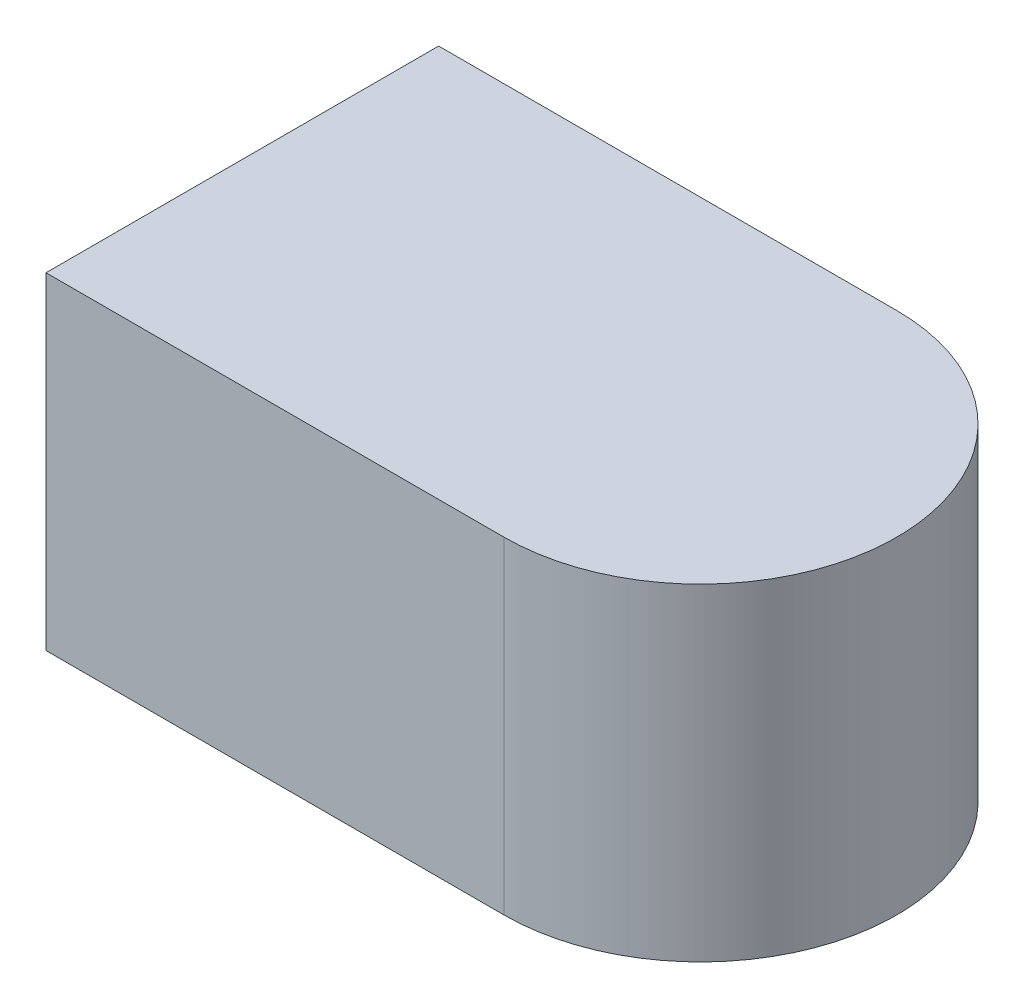
ISO-10303-21;
HEADER;
FILE_DESCRIPTION(('STEP AP214'),'2;1');
FILE_NAME('part.step','',(''),(''),'','','');
FILE_SCHEMA(('AUTOMOTIVE_DESIGN { 1 0 10303 214 1 1 1 1 }'));
ENDSEC;
DATA;
#1=APPLICATION_CONTEXT('core data for automotive mechanical design processes');
#2=APPLICATION_PROTOCOL_DEFINITION('international standard','automotive_design',2000,#1);
#3=PRODUCT_CONTEXT('',#1,'mechanical');
#4=PRODUCT('Part','Part','',(#3));
#5=PRODUCT_RELATED_PRODUCT_CATEGORY('part','',(#4));
#6=PRODUCT_DEFINITION_FORMATION('','',#4);
#7=PRODUCT_DEFINITION_CONTEXT('part definition',#1,'design');
#8=PRODUCT_DEFINITION('design','',#6,#7);
#9=PRODUCT_DEFINITION_SHAPE('','',#8);
#10=(LENGTH_UNIT() NAMED_UNIT(*) SI_UNIT(.MILLI.,.METRE.));
#11=(NAMED_UNIT(*) PLANE_ANGLE_UNIT() SI_UNIT($,.RADIAN.));
#12=(NAMED_UNIT(*) SI_UNIT($,.STERADIAN.) SOLID_ANGLE_UNIT());
#13=UNCERTAINTY_MEASURE_WITH_UNIT(LENGTH_MEASURE(1.E-05),#10,'distance_accuracy_value','');
#14=(GEOMETRIC_REPRESENTATION_CONTEXT(3) GLOBAL_UNCERTAINTY_ASSIGNED_CONTEXT((#13)) GLOBAL_UNIT_ASSIGNED_CONTEXT((#10,
#11,#12)) REPRESENTATION_CONTEXT('',''));
#15=CARTESIAN_POINT('',(0.,0.,0.));
#16=DIRECTION('',(0.,0.,1.));
#17=DIRECTION('',(1.,0.,0.));
#18=AXIS2_PLACEMENT_3D('',#15,#16,#17);
#19=CARTESIAN_POINT('',(0.,0.,0.));
#20=DIRECTION('',(0.,-1.,0.));
#21=DIRECTION('',(-1.,0.,0.));
#22=AXIS2_PLACEMENT_3D('',#19,#20,#21);
#23=PLANE('',#22);
#24=CARTESIAN_POINT('',(-1.47,0.,-1.75));
#25=DIRECTION('',(0.,-1.,0.));
#26=DIRECTION('',(0.,0.,-1.));
#27=AXIS2_PLACEMENT_3D('',#24,#25,#26);
#28=CIRCLE('',#27,0.12);
#29=CARTESIAN_POINT('',(-1.47,0.,-1.87));
#30=VERTEX_POINT('',#29);
#31=CARTESIAN_POINT('',(-1.47,0.,-1.63));
#32=VERTEX_POINT('',#31);
#33=EDGE_CURVE('E11',#30,#32,#28,.T.);
#34=ORIENTED_EDGE('',*,*,#33,.T.);
#35=DIRECTION('',(-1.,0.,0.));
#36=VECTOR('',#35,1.);
#37=CARTESIAN_POINT('',(-1.47,0.,-1.63));
#38=LINE('',#37,#36);
#39=CARTESIAN_POINT('',(-1.75,0.,-1.63));
#40=VERTEX_POINT('',#39);
#41=EDGE_CURVE('E24',#32,#40,#38,.T.);
#42=ORIENTED_EDGE('',*,*,#41,.T.);
#43=DIRECTION('',(0.,0.,-1.));
#44=VECTOR('',#43,1.);
#45=CARTESIAN_POINT('',(-1.75,0.,-1.63));
#46=LINE('',#45,#44);
#47=CARTESIAN_POINT('',(-1.75,0.,-1.87));
#48=VERTEX_POINT('',#47);
#49=EDGE_CURVE('E62',#40,#48,#46,.T.);
#50=ORIENTED_EDGE('',*,*,#49,.T.);
#51=DIRECTION('',(1.,0.,0.));
#52=VECTOR('',#51,1.);
#53=CARTESIAN_POINT('',(-1.75,0.,-1.87));
#54=LINE('',#53,#52);
#55=EDGE_CURVE('E36',#48,#30,#54,.T.);
#56=ORIENTED_EDGE('',*,*,#55,.T.);
#57=EDGE_LOOP('',(#34,#42,#50,#56));
#58=FACE_BOUND('',#57,.T.);
#59=ADVANCED_FACE('F17',(#58),#23,.T.);
#60=CARTESIAN_POINT('',(-1.75,0.,-1.87));
#61=DIRECTION('',(0.,0.,1.));
#62=DIRECTION('',(1.,0.,0.));
#63=AXIS2_PLACEMENT_3D('',#60,#61,#62);
#64=PLANE('',#63);
#65=DIRECTION('',(0.,1.,0.));
#66=VECTOR('',#65,1.);
#67=CARTESIAN_POINT('',(-1.75,0.,-1.87));
#68=LINE('',#67,#66);
#69=CARTESIAN_POINT('',(-1.75,0.2,-1.87));
#70=VERTEX_POINT('',#69);
#71=EDGE_CURVE('E84',#48,#70,#68,.T.);
#72=ORIENTED_EDGE('',*,*,#71,.T.);
#73=DIRECTION('',(1.,0.,0.));
#74=VECTOR('',#73,1.);
#75=CARTESIAN_POINT('',(-1.75,0.2,-1.87));
#76=LINE('',#75,#74);
#77=CARTESIAN_POINT('',(-1.47,0.2,-1.87));
#78=VERTEX_POINT('',#77);
#79=EDGE_CURVE('E74',#70,#78,#76,.T.);
#80=ORIENTED_EDGE('',*,*,#79,.T.);
#81=DIRECTION('',(0.,1.,0.));
#82=VECTOR('',#81,1.);
#83=CARTESIAN_POINT('',(-1.47,0.,-1.87));
#84=LINE('',#83,#82);
#85=EDGE_CURVE('E81',#30,#78,#84,.T.);
#86=ORIENTED_EDGE('',*,*,#85,.F.);
#87=ORIENTED_EDGE('',*,*,#55,.F.);
#88=EDGE_LOOP('',(#72,#80,#86,#87));
#89=FACE_BOUND('',#88,.T.);
#90=ADVANCED_FACE('F91',(#89),#64,.F.);
#91=CARTESIAN_POINT('',(-1.47,0.,-1.75));
#92=DIRECTION('',(0.,-1.,0.));
#93=DIRECTION('',(-1.,0.,0.));
#94=AXIS2_PLACEMENT_3D('',#91,#92,#93);
#95=CYLINDRICAL_SURFACE('',#94,0.12);
#96=ORIENTED_EDGE('',*,*,#85,.T.);
#97=CARTESIAN_POINT('',(-1.47,0.2,-1.75));
#98=DIRECTION('',(0.,-1.,0.));
#99=DIRECTION('',(0.,0.,-1.));
#100=AXIS2_PLACEMENT_3D('',#97,#98,#99);
#101=CIRCLE('',#100,0.12);
#102=CARTESIAN_POINT('',(-1.47,0.2,-1.63));
#103=VERTEX_POINT('',#102);
#104=EDGE_CURVE('E79',#78,#103,#101,.T.);
#105=ORIENTED_EDGE('',*,*,#104,.T.);
#106=DIRECTION('',(0.,1.,0.));
#107=VECTOR('',#106,1.);
#108=CARTESIAN_POINT('',(-1.47,0.,-1.63));
#109=LINE('',#108,#107);
#110=EDGE_CURVE('E68',#32,#103,#109,.T.);
#111=ORIENTED_EDGE('',*,*,#110,.F.);
#112=ORIENTED_EDGE('',*,*,#33,.F.);
#113=EDGE_LOOP('',(#96,#105,#111,#112));
#114=FACE_BOUND('',#113,.T.);
#115=ADVANCED_FACE('F89',(#114),#95,.T.);
#116=CARTESIAN_POINT('',(-1.47,0.,-1.63));
#117=DIRECTION('',(0.,0.,-1.));
#118=DIRECTION('',(-1.,0.,0.));
#119=AXIS2_PLACEMENT_3D('',#116,#117,#118);
#120=PLANE('',#119);
#121=ORIENTED_EDGE('',*,*,#110,.T.);
#122=DIRECTION('',(-1.,0.,0.));
#123=VECTOR('',#122,1.);
#124=CARTESIAN_POINT('',(-1.47,0.2,-1.63));
#125=LINE('',#124,#123);
#126=CARTESIAN_POINT('',(-1.75,0.2,-1.63));
#127=VERTEX_POINT('',#126);
#128=EDGE_CURVE('E63',#103,#127,#125,.T.);
#129=ORIENTED_EDGE('',*,*,#128,.T.);
#130=DIRECTION('',(0.,1.,0.));
#131=VECTOR('',#130,1.);
#132=CARTESIAN_POINT('',(-1.75,0.,-1.63));
#133=LINE('',#132,#131);
#134=EDGE_CURVE('E56',#40,#127,#133,.T.);
#135=ORIENTED_EDGE('',*,*,#134,.F.);
#136=ORIENTED_EDGE('',*,*,#41,.F.);
#137=EDGE_LOOP('',(#121,#129,#135,#136));
#138=FACE_BOUND('',#137,.T.);
#139=ADVANCED_FACE('F66',(#138),#120,.F.);
#140=CARTESIAN_POINT('',(-1.75,0.,-1.63));
#141=DIRECTION('',(1.,0.,0.));
#142=DIRECTION('',(0.,0.,-1.));
#143=AXIS2_PLACEMENT_3D('',#140,#141,#142);
#144=PLANE('',#143);
#145=ORIENTED_EDGE('',*,*,#134,.T.);
#146=DIRECTION('',(0.,0.,-1.));
#147=VECTOR('',#146,1.);
#148=CARTESIAN_POINT('',(-1.75,0.2,-1.63));
#149=LINE('',#148,#147);
#150=EDGE_CURVE('E61',#127,#70,#149,.T.);
#151=ORIENTED_EDGE('',*,*,#150,.T.);
#152=ORIENTED_EDGE('',*,*,#71,.F.);
#153=ORIENTED_EDGE('',*,*,#49,.F.);
#154=EDGE_LOOP('',(#145,#151,#152,#153));
#155=FACE_BOUND('',#154,.T.);
#156=ADVANCED_FACE('F58',(#155),#144,.F.);
#157=CARTESIAN_POINT('',(0.,0.2,0.));
#158=DIRECTION('',(0.,-1.,0.));
#159=DIRECTION('',(-1.,0.,0.));
#160=AXIS2_PLACEMENT_3D('',#157,#158,#159);
#161=PLANE('',#160);
#162=ORIENTED_EDGE('',*,*,#150,.F.);
#163=ORIENTED_EDGE('',*,*,#128,.F.);
#164=ORIENTED_EDGE('',*,*,#104,.F.);
#165=ORIENTED_EDGE('',*,*,#79,.F.);
#166=EDGE_LOOP('',(#162,#163,#164,#165));
#167=FACE_BOUND('',#166,.T.);
#168=ADVANCED_FACE('F72',(#167),#161,.F.);
#169=CLOSED_SHELL('',(#59,#90,#115,#139,#156,#168));
#170=MANIFOLD_SOLID_BREP('B1',#169);
#171=ADVANCED_BREP_SHAPE_REPRESENTATION('',(#18,#170),#14);
#172=SHAPE_DEFINITION_REPRESENTATION(#9,#171);
ENDSEC;
END-ISO-10303-21;
